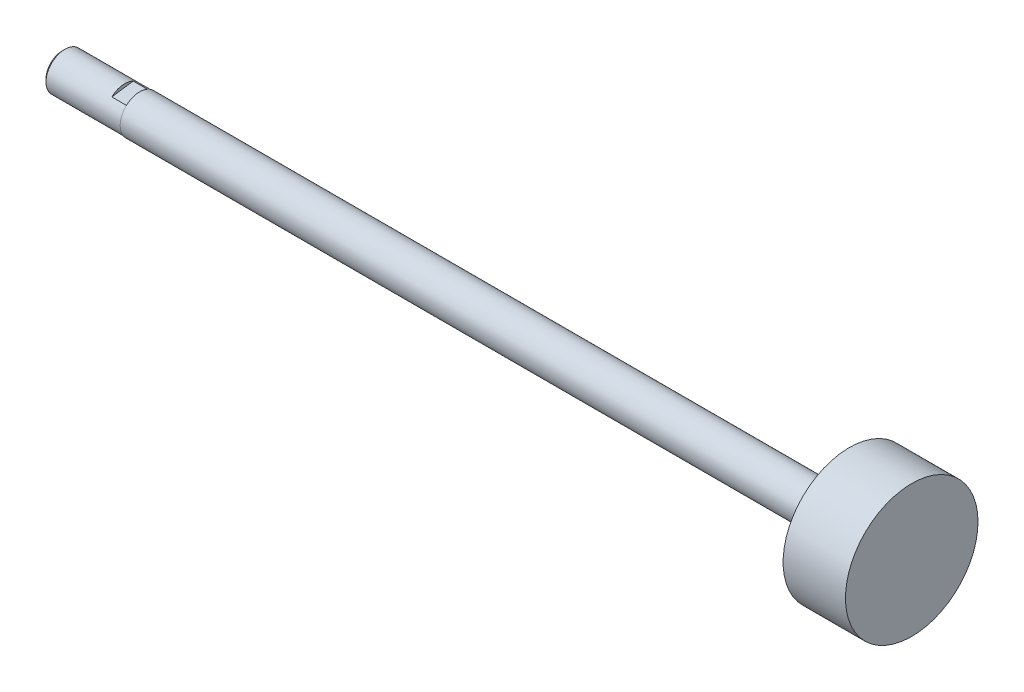
ISO-10303-21;
HEADER;
FILE_DESCRIPTION(('STEP AP214'),'2;1');
FILE_NAME('part.step','',(''),(''),'','','');
FILE_SCHEMA(('AUTOMOTIVE_DESIGN { 1 0 10303 214 1 1 1 1 }'));
ENDSEC;
DATA;
#1=APPLICATION_CONTEXT('core data for automotive mechanical design processes');
#2=APPLICATION_PROTOCOL_DEFINITION('international standard','automotive_design',2000,#1);
#3=PRODUCT_CONTEXT('',#1,'mechanical');
#4=PRODUCT('Part','Part','',(#3));
#5=PRODUCT_RELATED_PRODUCT_CATEGORY('part','',(#4));
#6=PRODUCT_DEFINITION_FORMATION('','',#4);
#7=PRODUCT_DEFINITION_CONTEXT('part definition',#1,'design');
#8=PRODUCT_DEFINITION('design','',#6,#7);
#9=PRODUCT_DEFINITION_SHAPE('','',#8);
#10=(LENGTH_UNIT() NAMED_UNIT(*) SI_UNIT(.MILLI.,.METRE.));
#11=(NAMED_UNIT(*) PLANE_ANGLE_UNIT() SI_UNIT($,.RADIAN.));
#12=(NAMED_UNIT(*) SI_UNIT($,.STERADIAN.) SOLID_ANGLE_UNIT());
#13=UNCERTAINTY_MEASURE_WITH_UNIT(LENGTH_MEASURE(1.E-05),#10,'distance_accuracy_value','');
#14=(GEOMETRIC_REPRESENTATION_CONTEXT(3) GLOBAL_UNCERTAINTY_ASSIGNED_CONTEXT((#13)) GLOBAL_UNIT_ASSIGNED_CONTEXT((#10,
#11,#12)) REPRESENTATION_CONTEXT('',''));
#15=CARTESIAN_POINT('',(0.,0.,0.));
#16=DIRECTION('',(0.,0.,1.));
#17=DIRECTION('',(1.,0.,0.));
#18=AXIS2_PLACEMENT_3D('',#15,#16,#17);
#19=CARTESIAN_POINT('',(745.549890202522,0.,0.));
#20=DIRECTION('',(1.,0.,0.));
#21=DIRECTION('',(0.,1.,0.));
#22=AXIS2_PLACEMENT_3D('',#19,#20,#21);
#23=PLANE('',#22);
#24=DIRECTION('',(0.,0.13986065989846,-0.99017119520453));
#25=VECTOR('',#24,1.);
#26=CARTESIAN_POINT('',(745.549890202522,-2.8359484783064,-2.6235076108126));
#27=LINE('',#26,#25);
#28=CARTESIAN_POINT('',(745.549890202522,-3.45163861124236,1.73539242045737));
#29=VERTEX_POINT('',#28);
#30=CARTESIAN_POINT('',(745.549890202522,-2.8359484783064,-2.62350761081259));
#31=VERTEX_POINT('',#30);
#32=EDGE_CURVE('E86',#29,#31,#27,.T.);
#33=ORIENTED_EDGE('',*,*,#32,.F.);
#34=CARTESIAN_POINT('',(745.549890202522,0.,0.));
#35=DIRECTION('',(1.,0.,0.));
#36=DIRECTION('',(0.,1.,0.));
#37=AXIS2_PLACEMENT_3D('',#34,#35,#36);
#38=CIRCLE('',#37,3.86334);
#39=EDGE_CURVE('E55',#29,#31,#38,.T.);
#40=ORIENTED_EDGE('',*,*,#39,.T.);
#41=EDGE_LOOP('',(#33,#40));
#42=FACE_BOUND('',#41,.T.);
#43=ADVANCED_FACE('F34',(#42),#23,.T.);
#44=CARTESIAN_POINT('',(732.849890202522,0.,0.));
#45=DIRECTION('',(1.,0.,0.));
#46=DIRECTION('',(0.,1.,0.));
#47=AXIS2_PLACEMENT_3D('',#44,#45,#46);
#48=CYLINDRICAL_SURFACE('',#47,3.86334);
#49=CARTESIAN_POINT('',(733.385830202517,0.,0.));
#50=DIRECTION('',(-1.,0.,0.));
#51=DIRECTION('',(0.,-1.,0.));
#52=AXIS2_PLACEMENT_3D('',#49,#50,#51);
#53=CIRCLE('',#52,3.86334);
#54=CARTESIAN_POINT('',(733.385830202517,-3.86334,0.));
#55=VERTEX_POINT('',#54);
#56=EDGE_CURVE('E42',#55,#55,#53,.F.);
#57=ORIENTED_EDGE('',*,*,#56,.T.);
#58=EDGE_LOOP('',(#57));
#59=FACE_BOUND('',#58,.T.);
#60=ORIENTED_EDGE('',*,*,#39,.F.);
#61=DIRECTION('',(-1.,0.,0.));
#62=VECTOR('',#61,1.);
#63=CARTESIAN_POINT('',(748.597890202522,-3.45163861124236,1.73539242045736));
#64=LINE('',#63,#62);
#65=CARTESIAN_POINT('',(748.597890202522,-3.45163861124236,1.73539242045736));
#66=VERTEX_POINT('',#65);
#67=EDGE_CURVE('E94',#66,#29,#64,.T.);
#68=ORIENTED_EDGE('',*,*,#67,.F.);
#69=CARTESIAN_POINT('',(748.597890202522,0.,0.));
#70=DIRECTION('',(1.,0.,0.));
#71=DIRECTION('',(0.,-1.,0.));
#72=AXIS2_PLACEMENT_3D('',#69,#70,#71);
#73=CIRCLE('',#72,3.86334);
#74=CARTESIAN_POINT('',(748.597890202522,2.8359484783064,2.62350761081258));
#75=VERTEX_POINT('',#74);
#76=EDGE_CURVE('E98',#75,#66,#73,.T.);
#77=ORIENTED_EDGE('',*,*,#76,.F.);
#78=DIRECTION('',(-1.,0.,0.));
#79=VECTOR('',#78,1.);
#80=CARTESIAN_POINT('',(748.597890202522,2.8359484783064,2.62350761081258));
#81=LINE('',#80,#79);
#82=CARTESIAN_POINT('',(745.549890202522,2.8359484783064,2.62350761081258));
#83=VERTEX_POINT('',#82);
#84=EDGE_CURVE('E107',#75,#83,#81,.T.);
#85=ORIENTED_EDGE('',*,*,#84,.T.);
#86=CARTESIAN_POINT('',(745.549890202522,3.45163861124236,-1.73539242045736));
#87=VERTEX_POINT('',#86);
#88=EDGE_CURVE('E111',#87,#83,#38,.T.);
#89=ORIENTED_EDGE('',*,*,#88,.F.);
#90=DIRECTION('',(-1.,0.,0.));
#91=VECTOR('',#90,1.);
#92=CARTESIAN_POINT('',(748.597890202522,3.45163861124236,-1.73539242045737));
#93=LINE('',#92,#91);
#94=CARTESIAN_POINT('',(748.597890202522,3.45163861124236,-1.73539242045737));
#95=VERTEX_POINT('',#94);
#96=EDGE_CURVE('E81',#95,#87,#93,.T.);
#97=ORIENTED_EDGE('',*,*,#96,.F.);
#98=CARTESIAN_POINT('',(748.597890202522,0.,0.));
#99=DIRECTION('',(1.,0.,0.));
#100=DIRECTION('',(0.,-1.,0.));
#101=AXIS2_PLACEMENT_3D('',#98,#99,#100);
#102=CIRCLE('',#101,3.86334);
#103=CARTESIAN_POINT('',(748.597890202522,-2.8359484783064,-2.6235076108126));
#104=VERTEX_POINT('',#103);
#105=EDGE_CURVE('E76',#104,#95,#102,.T.);
#106=ORIENTED_EDGE('',*,*,#105,.F.);
#107=DIRECTION('',(-1.,0.,0.));
#108=VECTOR('',#107,1.);
#109=CARTESIAN_POINT('',(748.597890202522,-2.8359484783064,-2.6235076108126));
#110=LINE('',#109,#108);
#111=EDGE_CURVE('E79',#104,#31,#110,.T.);
#112=ORIENTED_EDGE('',*,*,#111,.T.);
#113=EDGE_LOOP('',(#60,#68,#77,#85,#89,#97,#106,#112));
#114=FACE_BOUND('',#113,.T.);
#115=ADVANCED_FACE('F78',(#59,#114),#48,.T.);
#116=CARTESIAN_POINT('',(732.849890202522,3.86333999999999,0.));
#117=DIRECTION('',(-1.,0.,0.));
#118=DIRECTION('',(0.,-1.,0.));
#119=AXIS2_PLACEMENT_3D('',#116,#117,#118);
#120=PLANE('',#119);
#121=CARTESIAN_POINT('',(732.849890202522,0.,0.));
#122=DIRECTION('',(-1.,0.,0.));
#123=DIRECTION('',(0.,-1.,0.));
#124=AXIS2_PLACEMENT_3D('',#121,#122,#123);
#125=CIRCLE('',#124,3.32740000000568);
#126=CARTESIAN_POINT('',(732.849890202522,-3.32740000000569,0.));
#127=VERTEX_POINT('',#126);
#128=EDGE_CURVE('E11',#127,#127,#125,.T.);
#129=ORIENTED_EDGE('',*,*,#128,.T.);
#130=EDGE_LOOP('',(#129));
#131=FACE_BOUND('',#130,.T.);
#132=ADVANCED_FACE('F132',(#131),#120,.T.);
#133=DIRECTION('',(0.,-0.13986065989846,0.99017119520453));
#134=VECTOR('',#133,1.);
#135=CARTESIAN_POINT('',(745.549890202522,2.8359484783064,2.62350761081258));
#136=LINE('',#135,#134);
#137=EDGE_CURVE('E48',#87,#83,#136,.T.);
#138=ORIENTED_EDGE('',*,*,#137,.F.);
#139=ORIENTED_EDGE('',*,*,#88,.T.);
#140=EDGE_LOOP('',(#138,#139));
#141=FACE_BOUND('',#140,.T.);
#142=ADVANCED_FACE('F128',(#141),#23,.T.);
#143=CARTESIAN_POINT('',(748.597890202522,2.8359484783064,2.62350761081258));
#144=DIRECTION('',(0.,-0.99017119520453,-0.13986065989846));
#145=DIRECTION('',(0.,0.13986065989846,-0.99017119520453));
#146=AXIS2_PLACEMENT_3D('',#143,#144,#145);
#147=PLANE('',#146);
#148=ORIENTED_EDGE('',*,*,#137,.T.);
#149=ORIENTED_EDGE('',*,*,#84,.F.);
#150=DIRECTION('',(0.,-0.13986065989846,0.99017119520453));
#151=VECTOR('',#150,1.);
#152=CARTESIAN_POINT('',(748.597890202522,2.8359484783064,2.62350761081258));
#153=LINE('',#152,#151);
#154=EDGE_CURVE('E85',#95,#75,#153,.T.);
#155=ORIENTED_EDGE('',*,*,#154,.F.);
#156=ORIENTED_EDGE('',*,*,#96,.T.);
#157=EDGE_LOOP('',(#148,#149,#155,#156));
#158=FACE_BOUND('',#157,.T.);
#159=ADVANCED_FACE('F136',(#158),#147,.F.);
#160=CARTESIAN_POINT('',(748.597890202522,-2.8359484783064,-2.6235076108126));
#161=DIRECTION('',(0.,0.99017119520453,0.13986065989846));
#162=DIRECTION('',(0.,-0.13986065989846,0.99017119520453));
#163=AXIS2_PLACEMENT_3D('',#160,#161,#162);
#164=PLANE('',#163);
#165=ORIENTED_EDGE('',*,*,#32,.T.);
#166=ORIENTED_EDGE('',*,*,#111,.F.);
#167=DIRECTION('',(0.,0.13986065989846,-0.99017119520453));
#168=VECTOR('',#167,1.);
#169=CARTESIAN_POINT('',(748.597890202522,-2.8359484783064,-2.6235076108126));
#170=LINE('',#169,#168);
#171=EDGE_CURVE('E92',#66,#104,#170,.T.);
#172=ORIENTED_EDGE('',*,*,#171,.F.);
#173=ORIENTED_EDGE('',*,*,#67,.T.);
#174=EDGE_LOOP('',(#165,#166,#172,#173));
#175=FACE_BOUND('',#174,.T.);
#176=ADVANCED_FACE('F90',(#175),#164,.F.);
#177=CARTESIAN_POINT('',(748.597890202522,0.,0.));
#178=DIRECTION('',(1.,0.,0.));
#179=DIRECTION('',(0.,0.,-1.));
#180=AXIS2_PLACEMENT_3D('',#177,#178,#179);
#181=PLANE('',#180);
#182=CARTESIAN_POINT('',(748.597890202522,0.,0.));
#183=DIRECTION('',(-1.,0.,0.));
#184=DIRECTION('',(0.,0.,-1.));
#185=AXIS2_PLACEMENT_3D('',#182,#183,#184);
#186=CIRCLE('',#185,3.9624);
#187=CARTESIAN_POINT('',(748.597890202522,0.,-3.9624));
#188=VERTEX_POINT('',#187);
#189=EDGE_CURVE('E104',#188,#188,#186,.T.);
#190=ORIENTED_EDGE('',*,*,#189,.T.);
#191=EDGE_LOOP('',(#190));
#192=FACE_BOUND('',#191,.T.);
#193=ORIENTED_EDGE('',*,*,#171,.T.);
#194=ORIENTED_EDGE('',*,*,#105,.T.);
#195=ORIENTED_EDGE('',*,*,#154,.T.);
#196=ORIENTED_EDGE('',*,*,#76,.T.);
#197=EDGE_LOOP('',(#193,#194,#195,#196));
#198=FACE_BOUND('',#197,.T.);
#199=ADVANCED_FACE('F96',(#192,#198),#181,.F.);
#200=CARTESIAN_POINT('',(893.123890202522,0.,0.));
#201=DIRECTION('',(-1.,0.,0.));
#202=DIRECTION('',(0.,0.,1.));
#203=AXIS2_PLACEMENT_3D('',#200,#201,#202);
#204=CYLINDRICAL_SURFACE('',#203,3.9624);
#205=CARTESIAN_POINT('',(893.123890202522,0.,0.));
#206=DIRECTION('',(-1.,0.,0.));
#207=DIRECTION('',(0.,0.,-1.));
#208=AXIS2_PLACEMENT_3D('',#205,#206,#207);
#209=CIRCLE('',#208,3.9624);
#210=CARTESIAN_POINT('',(893.123890202522,0.,-3.9624));
#211=VERTEX_POINT('',#210);
#212=EDGE_CURVE('E231',#211,#211,#209,.T.);
#213=ORIENTED_EDGE('',*,*,#212,.T.);
#214=EDGE_LOOP('',(#213));
#215=FACE_BOUND('',#214,.T.);
#216=ORIENTED_EDGE('',*,*,#189,.F.);
#217=EDGE_LOOP('',(#216));
#218=FACE_BOUND('',#217,.T.);
#219=ADVANCED_FACE('F177',(#215,#218),#204,.T.);
#220=CARTESIAN_POINT('',(905.823890202522,0.,0.));
#221=DIRECTION('',(-1.,0.,0.));
#222=DIRECTION('',(0.,0.,1.));
#223=AXIS2_PLACEMENT_3D('',#220,#221,#222);
#224=CYLINDRICAL_SURFACE('',#223,13.49375);
#225=CARTESIAN_POINT('',(905.823890202522,0.,0.));
#226=DIRECTION('',(-1.,0.,0.));
#227=DIRECTION('',(0.,0.,-1.));
#228=AXIS2_PLACEMENT_3D('',#225,#226,#227);
#229=CIRCLE('',#228,13.49375);
#230=CARTESIAN_POINT('',(905.823890202522,0.,-13.49375));
#231=VERTEX_POINT('',#230);
#232=EDGE_CURVE('E234',#231,#231,#229,.T.);
#233=ORIENTED_EDGE('',*,*,#232,.T.);
#234=EDGE_LOOP('',(#233));
#235=FACE_BOUND('',#234,.T.);
#236=CARTESIAN_POINT('',(893.123890202522,0.,0.));
#237=DIRECTION('',(-1.,0.,0.));
#238=DIRECTION('',(0.,0.,-1.));
#239=AXIS2_PLACEMENT_3D('',#236,#237,#238);
#240=CIRCLE('',#239,13.49375);
#241=CARTESIAN_POINT('',(893.123890202522,0.,-13.49375));
#242=VERTEX_POINT('',#241);
#243=EDGE_CURVE('E237',#242,#242,#240,.T.);
#244=ORIENTED_EDGE('',*,*,#243,.F.);
#245=EDGE_LOOP('',(#244));
#246=FACE_BOUND('',#245,.T.);
#247=ADVANCED_FACE('F167',(#235,#246),#224,.T.);
#248=CARTESIAN_POINT('',(905.823890202522,0.,0.));
#249=DIRECTION('',(1.,0.,0.));
#250=DIRECTION('',(0.,0.,-1.));
#251=AXIS2_PLACEMENT_3D('',#248,#249,#250);
#252=PLANE('',#251);
#253=ORIENTED_EDGE('',*,*,#232,.F.);
#254=EDGE_LOOP('',(#253));
#255=FACE_BOUND('',#254,.T.);
#256=ADVANCED_FACE('F122',(#255),#252,.T.);
#257=CARTESIAN_POINT('',(893.123890202522,0.,0.));
#258=DIRECTION('',(1.,0.,0.));
#259=DIRECTION('',(0.,0.,-1.));
#260=AXIS2_PLACEMENT_3D('',#257,#258,#259);
#261=PLANE('',#260);
#262=ORIENTED_EDGE('',*,*,#212,.F.);
#263=EDGE_LOOP('',(#262));
#264=FACE_BOUND('',#263,.T.);
#265=ORIENTED_EDGE('',*,*,#243,.T.);
#266=EDGE_LOOP('',(#265));
#267=FACE_BOUND('',#266,.T.);
#268=ADVANCED_FACE('F117',(#264,#267),#261,.F.);
#269=CARTESIAN_POINT('',(733.385830202517,0.,0.));
#270=DIRECTION('',(1.,0.,0.));
#271=DIRECTION('',(0.,1.,0.));
#272=AXIS2_PLACEMENT_3D('',#269,#270,#271);
#273=CONICAL_SURFACE('',#272,3.86334,0.785398163397413);
#274=ORIENTED_EDGE('',*,*,#128,.F.);
#275=EDGE_LOOP('',(#274));
#276=FACE_BOUND('',#275,.T.);
#277=ORIENTED_EDGE('',*,*,#56,.F.);
#278=EDGE_LOOP('',(#277));
#279=FACE_BOUND('',#278,.T.);
#280=ADVANCED_FACE('F36',(#276,#279),#273,.T.);
#281=CLOSED_SHELL('',(#43,#115,#132,#142,#159,#176,#199,#219,#247,#256,#268,#280));
#282=MANIFOLD_SOLID_BREP('B2',#281);
#283=ADVANCED_BREP_SHAPE_REPRESENTATION('',(#18,#282),#14);
#284=SHAPE_DEFINITION_REPRESENTATION(#9,#283);
ENDSEC;
END-ISO-10303-21;
